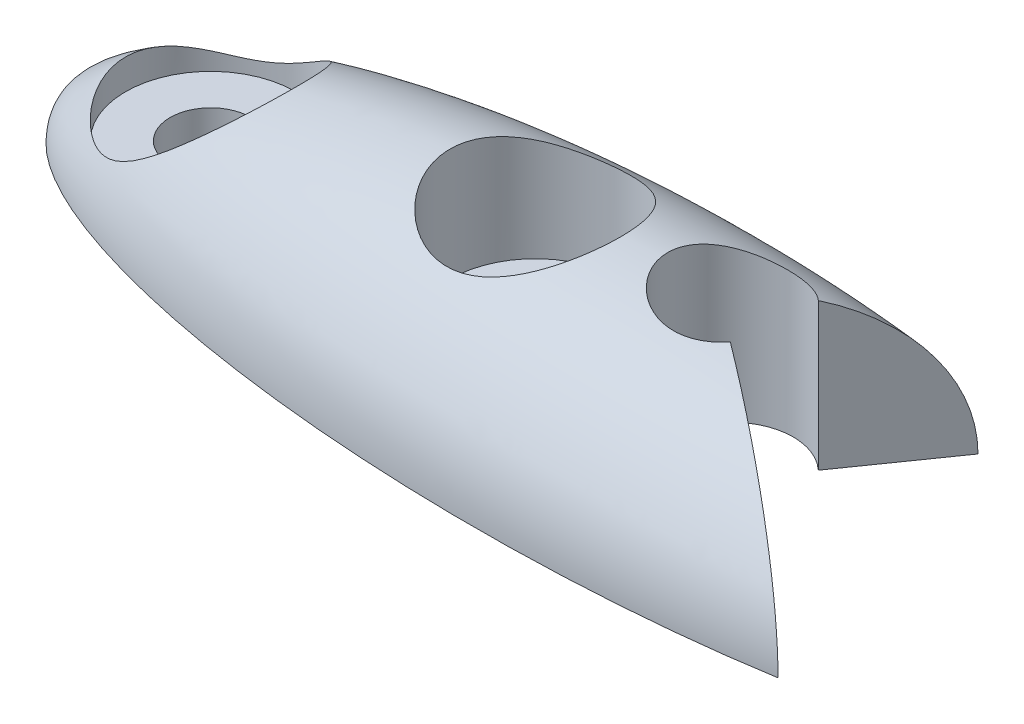
ISO-10303-21;
HEADER;
FILE_DESCRIPTION(('STEP AP214'),'2;1');
FILE_NAME('part.step','',(''),(''),'','','');
FILE_SCHEMA(('AUTOMOTIVE_DESIGN { 1 0 10303 214 1 1 1 1 }'));
ENDSEC;
DATA;
#1=APPLICATION_CONTEXT('core data for automotive mechanical design processes');
#2=APPLICATION_PROTOCOL_DEFINITION('international standard','automotive_design',2000,#1);
#3=PRODUCT_CONTEXT('',#1,'mechanical');
#4=PRODUCT('Part','Part','',(#3));
#5=PRODUCT_RELATED_PRODUCT_CATEGORY('part','',(#4));
#6=PRODUCT_DEFINITION_FORMATION('','',#4);
#7=PRODUCT_DEFINITION_CONTEXT('part definition',#1,'design');
#8=PRODUCT_DEFINITION('design','',#6,#7);
#9=PRODUCT_DEFINITION_SHAPE('','',#8);
#10=(LENGTH_UNIT() NAMED_UNIT(*) SI_UNIT(.MILLI.,.METRE.));
#11=(NAMED_UNIT(*) PLANE_ANGLE_UNIT() SI_UNIT($,.RADIAN.));
#12=(NAMED_UNIT(*) SI_UNIT($,.STERADIAN.) SOLID_ANGLE_UNIT());
#13=UNCERTAINTY_MEASURE_WITH_UNIT(LENGTH_MEASURE(1.E-05),#10,'distance_accuracy_value','');
#14=(GEOMETRIC_REPRESENTATION_CONTEXT(3) GLOBAL_UNCERTAINTY_ASSIGNED_CONTEXT((#13)) GLOBAL_UNIT_ASSIGNED_CONTEXT((#10,
#11,#12)) REPRESENTATION_CONTEXT('',''));
#15=CARTESIAN_POINT('',(0.,0.,0.));
#16=DIRECTION('',(0.,0.,1.));
#17=DIRECTION('',(1.,0.,0.));
#18=AXIS2_PLACEMENT_3D('',#15,#16,#17);
#19=CARTESIAN_POINT('',(0.,0.,0.));
#20=DIRECTION('',(0.,0.,1.));
#21=DIRECTION('',(1.,0.,0.));
#22=AXIS2_PLACEMENT_3D('',#19,#20,#21);
#23=ELLIPSE('',#22,14.,4.);
#24=TRIMMED_CURVE('',#23,(PARAMETER_VALUE(0.)),(PARAMETER_VALUE(3.14159265358979)),.T.,.PARAMETER.);
#25=CARTESIAN_POINT('',(-14.,0.,0.));
#26=DIRECTION('',(-1.,0.,0.));
#27=AXIS1_PLACEMENT('',#25,#26);
#28=SURFACE_OF_REVOLUTION('',#24,#27);
#29=CARTESIAN_POINT('',(0.,0.,0.));
#30=DIRECTION('',(0.,-1.,0.));
#31=DIRECTION('',(1.,0.,0.));
#32=AXIS2_PLACEMENT_3D('',#29,#30,#31);
#33=ELLIPSE('',#32,14.,4.);
#34=CARTESIAN_POINT('',(-14.,0.,0.));
#35=VERTEX_POINT('',#34);
#36=CARTESIAN_POINT('',(6.95727438490027,0.,3.47112089328106));
#37=VERTEX_POINT('',#36);
#38=EDGE_CURVE('E84',#35,#37,#33,.F.);
#39=ORIENTED_EDGE('',*,*,#38,.T.);
#40=CARTESIAN_POINT('',(6.95727438490027,0.,3.47112089328106));
#41=CARTESIAN_POINT('',(6.95729899317832,0.0771336940388308,3.47113812418285));
#42=CARTESIAN_POINT('',(6.954298902265,0.154250742922995,3.46903743791003));
#43=CARTESIAN_POINT('',(6.94243897243188,0.307743482883708,3.46073302563824));
#44=CARTESIAN_POINT('',(6.93358436457972,0.384119774075948,3.45453296247227));
#45=CARTESIAN_POINT('',(6.91031169026689,0.534868107737033,3.43823726048412));
#46=CARTESIAN_POINT('',(6.8959454148598,0.60925210988235,3.42817788614808));
#47=CARTESIAN_POINT('',(6.86197985583381,0.756206963489012,3.40439494567858));
#48=CARTESIAN_POINT('',(6.84237966872788,0.828777499539159,3.39067074691669));
#49=CARTESIAN_POINT('',(6.77644864333839,1.04259610943281,3.34450534593707));
#50=CARTESIAN_POINT('',(6.72288263608913,1.18059667751262,3.30699802386934));
#51=CARTESIAN_POINT('',(6.59986786402217,1.44573130953799,3.22086215315691));
#52=CARTESIAN_POINT('',(6.5303799706593,1.57283752493454,3.17220620640991));
#53=CARTESIAN_POINT('',(6.33635807267948,1.88330560454339,3.03635061086669));
#54=CARTESIAN_POINT('',(6.20279080908759,2.05830573893602,2.94282580604161));
#55=CARTESIAN_POINT('',(5.98710153145079,2.29982712178934,2.79179854792931));
#56=CARTESIAN_POINT('',(5.91251520114663,2.37694574702038,2.73957263720294));
#57=CARTESIAN_POINT('',(5.75904736922963,2.52453888042254,2.63211330442195));
#58=CARTESIAN_POINT('',(5.68016680526079,2.59501482991238,2.57688053891274));
#59=CARTESIAN_POINT('',(5.47431103299032,2.76682451454316,2.43273877538498));
#60=CARTESIAN_POINT('',(5.34483884855021,2.86369812884029,2.34208137585153));
#61=CARTESIAN_POINT('',(5.07948946919851,3.04341493222124,2.15628174017021));
#62=CARTESIAN_POINT('',(4.94360838099536,3.1262494487498,2.06113677791022));
#63=CARTESIAN_POINT('',(4.66688614683443,3.2789891827494,1.86737378356051));
#64=CARTESIAN_POINT('',(4.52603919590061,3.34887862811258,1.7687516867828));
#65=CARTESIAN_POINT('',(4.24076946080094,3.47646779310077,1.56900366784292));
#66=CARTESIAN_POINT('',(4.09634796341963,3.53417182999416,1.46787864669699));
#67=CARTESIAN_POINT('',(3.80003230031936,3.63984428167666,1.26039618570457));
#68=CARTESIAN_POINT('',(3.64804804286362,3.68743376863302,1.15397566294486));
#69=CARTESIAN_POINT('',(3.34279582600389,3.7707655516461,0.940235759644455));
#70=CARTESIAN_POINT('',(3.18953968787248,3.8065721917558,0.832924656447932));
#71=CARTESIAN_POINT('',(3.0356041302635,3.83691790722989,0.725137818611613));
#72=B_SPLINE_CURVE_WITH_KNOTS('',3,(#40,#41,#42,#43,#44,#45,#46,#47,#48,#49,#50,#51,#52,#53,#54,
#55,#56,#57,#58,#59,#60,#61,#62,#63,#64,#65,#66,#67,#68,#69,#70,#71),.UNSPECIFIED.,.F.,.F.,(4,2,
2,2,2,2,2,2,2,2,2,2,2,2,2,4),(0.,0.231287168003758,0.462367957448948,0.691328542939971,
0.920328677587783,1.37638002368096,1.83356438504328,2.54679526486869,2.90457330058979,
3.26227352654519,3.81757134845218,4.37321096122764,4.92952316784419,5.48563794211939,
6.05989116301108,6.63095433495631),.UNSPECIFIED.);
#73=CARTESIAN_POINT('',(3.0356041302635,3.836917907232,0.725137818611614));
#74=VERTEX_POINT('',#73);
#75=EDGE_CURVE('E70',#37,#74,#72,.T.);
#76=ORIENTED_EDGE('',*,*,#75,.T.);
#77=CARTESIAN_POINT('',(2.,3.49483467244949,-1.86));
#78=CARTESIAN_POINT('',(2.07813398084002,3.49118119917353,-1.86000374012296));
#79=CARTESIAN_POINT('',(2.15639189001948,3.49058815836243,-1.85387220877687));
#80=CARTESIAN_POINT('',(2.31081171926084,3.49536446472796,-1.82952462385525));
#81=CARTESIAN_POINT('',(2.38697370305525,3.50073363040114,-1.8113089381563));
#82=CARTESIAN_POINT('',(2.53483922547501,3.51659083272284,-1.76355724725854));
#83=CARTESIAN_POINT('',(2.60655391533183,3.52706543006083,-1.73405100640276));
#84=CARTESIAN_POINT('',(2.74407549456442,3.55186760177625,-1.66471740475829));
#85=CARTESIAN_POINT('',(2.80988028597874,3.56619653725444,-1.62488639811689));
#86=CARTESIAN_POINT('',(2.93742660450267,3.59806113498987,-1.5337471622023));
#87=CARTESIAN_POINT('',(2.99879397013011,3.61572238289601,-1.48196011416181));
#88=CARTESIAN_POINT('',(3.11237572388723,3.65206294309498,-1.36946253888777));
#89=CARTESIAN_POINT('',(3.16458692142663,3.67074260730811,-1.30874891456315));
#90=CARTESIAN_POINT('',(3.26229638595636,3.70895594542442,-1.17484754417608));
#91=CARTESIAN_POINT('',(3.30700157639869,3.7284491426146,-1.10106670366859));
#92=CARTESIAN_POINT('',(3.3832880658407,3.76513054238539,-0.946465458313844));
#93=CARTESIAN_POINT('',(3.41486998768289,3.78231885433176,-0.865645387775261));
#94=CARTESIAN_POINT('',(3.46347564235183,3.81284803287557,-0.700006662062822));
#95=CARTESIAN_POINT('',(3.48065331999071,3.8262285472587,-0.615240784158994));
#96=CARTESIAN_POINT('',(3.50016742024773,3.84847500453911,-0.443444497647411));
#97=CARTESIAN_POINT('',(3.50250978655014,3.85734275414055,-0.356415009976597));
#98=CARTESIAN_POINT('',(3.49233294347423,3.8698730802571,-0.18768897121882));
#99=CARTESIAN_POINT('',(3.48062278868515,3.87379475529151,-0.105962011557058));
#100=CARTESIAN_POINT('',(3.44392763315357,3.87753544019282,0.0545462099579809));
#101=CARTESIAN_POINT('',(3.41894362095768,3.87735475553374,0.133327690702898));
#102=CARTESIAN_POINT('',(3.35697599682675,3.87361639650224,0.28433313752473));
#103=CARTESIAN_POINT('',(3.32020564053266,3.87011672068354,0.356646427794222));
#104=CARTESIAN_POINT('',(3.23559044296188,3.86082280970727,0.494310726404858));
#105=CARTESIAN_POINT('',(3.18774377020389,3.85502819496622,0.559660580721635));
#106=CARTESIAN_POINT('',(3.08071018563367,3.84216894991756,0.683531225712975));
#107=CARTESIAN_POINT('',(3.02123557278116,3.83507246349745,0.741800161986131));
#108=CARTESIAN_POINT('',(2.89345638754544,3.8211390044576,0.847735440121681));
#109=CARTESIAN_POINT('',(2.82515065837589,3.81430206598805,0.895400390740512));
#110=CARTESIAN_POINT('',(2.68010345158286,3.80213624965375,0.979635732692089));
#111=CARTESIAN_POINT('',(2.60322570791636,3.79683868871741,1.01597669214485));
#112=CARTESIAN_POINT('',(2.44431511974431,3.78914919444723,1.07519000791509));
#113=CARTESIAN_POINT('',(2.36228339574874,3.78675663183043,1.09806528062665));
#114=CARTESIAN_POINT('',(2.19733076248174,3.7856795935481,1.12927852098915));
#115=CARTESIAN_POINT('',(2.11446850878938,3.78691518764403,1.13792339843417));
#116=CARTESIAN_POINT('',(1.94861034174323,3.79312322111809,1.14141337128388));
#117=CARTESIAN_POINT('',(1.86561443852983,3.79809538919599,1.13625946850257));
#118=CARTESIAN_POINT('',(1.70315733001067,3.8113073210463,1.11258611708747));
#119=CARTESIAN_POINT('',(1.62366086740444,3.81949372784729,1.09428105696014));
#120=CARTESIAN_POINT('',(1.50770054438527,3.83359211152056,1.05749508512385));
#121=CARTESIAN_POINT('',(1.46958457794677,3.83859631045396,1.04367333457854));
#122=CARTESIAN_POINT('',(1.39461387059919,3.84908089668869,1.01300720808066));
#123=CARTESIAN_POINT('',(1.35776033197716,3.85456172124848,0.99616004118386));
#124=CARTESIAN_POINT('',(1.24753305355959,3.87180181192037,0.940266857150052));
#125=CARTESIAN_POINT('',(1.17656335493366,3.88409556621877,0.896524537990685));
#126=CARTESIAN_POINT('',(1.04282911683376,3.90864680174716,0.79789813224214));
#127=CARTESIAN_POINT('',(0.980065159595881,3.92090428034298,0.743013255740497));
#128=CARTESIAN_POINT('',(0.892560103519131,3.93828650954848,0.652620898601896));
#129=CARTESIAN_POINT('',(0.864178275139749,3.94397973120257,0.620679951502467));
#130=CARTESIAN_POINT('',(0.810221812349645,3.9547645453586,0.55446781211344));
#131=CARTESIAN_POINT('',(0.784644580397147,3.95985669489755,0.520198824467914));
#132=CARTESIAN_POINT('',(0.712380706445735,3.97395126574799,0.414167611376933));
#133=CARTESIAN_POINT('',(0.670120833995368,3.98178038233834,0.339138732164209));
#134=CARTESIAN_POINT('',(0.600009477424749,3.99278031204923,0.184974260773067));
#135=CARTESIAN_POINT('',(0.571776661189163,3.99607929046712,0.106020176668773));
#136=CARTESIAN_POINT('',(0.528852260301651,3.99757836848931,-0.0555350332339738));
#137=CARTESIAN_POINT('',(0.51415573365918,3.99578032995196,-0.1381348164661));
#138=CARTESIAN_POINT('',(0.499082483460972,3.98694898592746,-0.300316651283961));
#139=CARTESIAN_POINT('',(0.498051641217094,3.98017137943129,-0.379853004568259));
#140=CARTESIAN_POINT('',(0.5084493758468,3.9618493534093,-0.537539597040193));
#141=CARTESIAN_POINT('',(0.519878225372812,3.95030482957362,-0.615689805857132));
#142=CARTESIAN_POINT('',(0.554652845414492,3.92298905637996,-0.768863946664043));
#143=CARTESIAN_POINT('',(0.5780500729569,3.90719969694212,-0.843872853781919));
#144=CARTESIAN_POINT('',(0.635876953163032,3.8723514381495,-0.988690576415194));
#145=CARTESIAN_POINT('',(0.670309605748675,3.85329165040143,-1.0584979715599));
#146=CARTESIAN_POINT('',(0.751778044842553,3.81173267934246,-1.1959055876264));
#147=CARTESIAN_POINT('',(0.799494467082705,3.78908965620416,-1.26305772756657));
#148=CARTESIAN_POINT('',(0.905102839536795,3.74295890896315,-1.38855467501068));
#149=CARTESIAN_POINT('',(0.96299806036892,3.71947091529254,-1.44689664042361));
#150=CARTESIAN_POINT('',(1.05847616016047,3.68418465635237,-1.52851975770722));
#151=CARTESIAN_POINT('',(1.09289246246056,3.67205769585422,-1.555435515615));
#152=CARTESIAN_POINT('',(1.16402357899013,3.6483353833349,-1.60621521962495));
#153=CARTESIAN_POINT('',(1.20073620605052,3.63673954314448,-1.63008200576759));
#154=CARTESIAN_POINT('',(1.31410852755447,3.6031372853172,-1.69687475218746));
#155=CARTESIAN_POINT('',(1.39403490634876,3.58230381824152,-1.73502072482995));
#156=CARTESIAN_POINT('',(1.5597762347769,3.54616450090575,-1.79664947415311));
#157=CARTESIAN_POINT('',(1.64553962729876,3.53081624693128,-1.82024580610957));
#158=CARTESIAN_POINT('',(1.82081716070665,3.50725185904008,-1.85191018181923));
#159=CARTESIAN_POINT('',(1.91032696262704,3.49902770142476,-1.85999570752466));
#160=CARTESIAN_POINT('',(2.,3.49483467244949,-1.86));
#161=B_SPLINE_CURVE_WITH_KNOTS('',3,(#77,#78,#79,#80,#81,#82,#83,#84,#85,#86,#87,#88,#89,#90,
#91,#92,#93,#94,#95,#96,#97,#98,#99,#100,#101,#102,#103,#104,#105,#106,#107,#108,#109,#110,#111,
#112,#113,#114,#115,#116,#117,#118,#119,#120,#121,#122,#123,#124,#125,#126,#127,#128,#129,#130,
#131,#132,#133,#134,#135,#136,#137,#138,#139,#140,#141,#142,#143,#144,#145,#146,#147,#148,#149,
#150,#151,#152,#153,#154,#155,#156,#157,#158,#159,#160),.UNSPECIFIED.,.T.,.F.,(4,2,2,2,2,2,2,2,
2,2,2,2,2,2,2,2,2,2,2,2,2,2,2,2,2,2,2,2,2,2,2,2,2,2,2,2,2,2,2,2,2,4),(0.,0.23432618358403,
0.468645233929142,0.702350777523002,0.936138959259956,1.18175848764287,1.42746343612483,
1.69152724114886,1.9555785120275,2.21677041531258,2.47785766690364,2.72460740262986,
2.97133876468957,3.21383649335386,3.45637434796505,3.70591957097056,3.95549751504134,
4.20984504798451,4.4641374741343,4.71287002577553,4.96158451951682,5.20633391261261,
5.32877523671773,5.45133009857153,5.70292412784257,5.95453599922057,6.08371384848466,
6.21277102773639,6.47070884209065,6.72118739103048,6.97157445597457,7.20993074199577,
7.44829224401474,7.68768728412733,7.92714745779382,8.18237688541685,8.4376884729044,
8.57357221552781,8.70932844837196,8.98071002403127,9.2499458184562,9.51887798333614),.UNSPECIFIED.);
#162=CARTESIAN_POINT('',(3.02131845917517,3.62316589454559,-1.45859392176912));
#163=VERTEX_POINT('',#162);
#164=EDGE_CURVE('E82',#74,#163,#161,.T.);
#165=ORIENTED_EDGE('',*,*,#164,.T.);
#166=CARTESIAN_POINT('',(3.02131845919602,3.62316589455198,-1.45859392174973));
#167=CARTESIAN_POINT('',(3.10312318801509,3.57056346259623,-1.57542318215476));
#168=CARTESIAN_POINT('',(3.18364649371288,3.51176254992309,-1.69042238068334));
#169=CARTESIAN_POINT('',(3.34145901074546,3.3816743348428,-1.91580201232238));
#170=CARTESIAN_POINT('',(3.41874272475972,3.31036679434614,-2.02617459444547));
#171=CARTESIAN_POINT('',(3.56950902791259,3.15495951944685,-2.24149118977713));
#172=CARTESIAN_POINT('',(3.64297063543001,3.07079749084506,-2.3464052381252));
#173=CARTESIAN_POINT('',(3.78465295156627,2.89022835412037,-2.5487485555058));
#174=CARTESIAN_POINT('',(3.85287777412861,2.7938310191917,-2.64618369985855));
#175=CARTESIAN_POINT('',(4.01204663612491,2.54351704293118,-2.87350039285397));
#176=CARTESIAN_POINT('',(4.09968690789246,2.38302196207202,-2.99866367228914));
#177=CARTESIAN_POINT('',(4.21874837715094,2.12536913968606,-3.16870107229043));
#178=CARTESIAN_POINT('',(4.25635468892719,2.03671086264167,-3.2224084514946));
#179=CARTESIAN_POINT('',(4.32705362551475,1.85410081001322,-3.32337699686091));
#180=CARTESIAN_POINT('',(4.36014846067727,1.76015165875336,-3.37064131973173));
#181=CARTESIAN_POINT('',(4.42165899365845,1.56663044446219,-3.45848746480245));
#182=CARTESIAN_POINT('',(4.45003141462322,1.46701652500224,-3.49900748124972));
#183=CARTESIAN_POINT('',(4.50130955230663,1.26364572412119,-3.57224025137173));
#184=CARTESIAN_POINT('',(4.52421802820876,1.15989096477419,-3.60495694556886));
#185=CARTESIAN_POINT('',(4.56418494078839,0.949146274530476,-3.66203561210509));
#186=CARTESIAN_POINT('',(4.5812504417865,0.842160421719726,-3.68640767333961));
#187=CARTESIAN_POINT('',(4.6092594949214,0.625835522635707,-3.72640874674493));
#188=CARTESIAN_POINT('',(4.62020731486845,0.516498172248363,-3.74204385398049));
#189=CARTESIAN_POINT('',(4.63278076552365,0.339038530933366,-3.76000060247159));
#190=CARTESIAN_POINT('',(4.63637407431042,0.271322801591031,-3.76513237925302));
#191=CARTESIAN_POINT('',(4.6411638088188,0.135741653274764,-3.77197282904399));
#192=CARTESIAN_POINT('',(4.64236400844082,0.0678766392152351,-3.77368689174187));
#193=CARTESIAN_POINT('',(4.64236206356356,0.,-3.77368411416928));
#194=B_SPLINE_CURVE_WITH_KNOTS('',3,(#166,#167,#168,#169,#170,#171,#172,#173,#174,#175,#176,
#177,#178,#179,#180,#181,#182,#183,#184,#185,#186,#187,#188,#189,#190,#191,#192,#193),
.UNSPECIFIED.,.F.,.F.,(4,2,2,2,2,2,2,2,2,2,2,2,2,4),(0.,0.455968624057858,0.912682016180067,
1.37168335839429,1.83032034467316,2.4918819633124,2.82236091947257,3.15267737445217,
3.48587156815276,3.81889714748561,4.15151865587516,4.4839078305795,4.68780462428776,
4.89137962043056),.UNSPECIFIED.);
#195=CARTESIAN_POINT('',(4.64236206356355,0.,-3.77368411416928));
#196=VERTEX_POINT('',#195);
#197=EDGE_CURVE('E54',#163,#196,#194,.T.);
#198=ORIENTED_EDGE('',*,*,#197,.T.);
#199=CARTESIAN_POINT('',(0.,0.,0.));
#200=DIRECTION('',(0.,1.,0.));
#201=DIRECTION('',(1.,0.,0.));
#202=AXIS2_PLACEMENT_3D('',#199,#200,#201);
#203=ELLIPSE('',#202,14.,4.);
#204=EDGE_CURVE('E133',#196,#35,#203,.T.);
#205=ORIENTED_EDGE('',*,*,#204,.T.);
#206=EDGE_LOOP('',(#39,#76,#165,#198,#205));
#207=FACE_BOUND('',#206,.T.);
#208=CARTESIAN_POINT('',(-10.5,1.60934769394311,-2.1));
#209=CARTESIAN_POINT('',(-10.4209734122459,1.65143420426542,-2.10000131762377));
#210=CARTESIAN_POINT('',(-10.3434440073707,1.69639745496097,-2.0955506533599));
#211=CARTESIAN_POINT('',(-10.1913598551556,1.78981821811153,-2.07860705529194));
#212=CARTESIAN_POINT('',(-10.1168101155128,1.83828125799034,-2.06610114131829));
#213=CARTESIAN_POINT('',(-9.9702390854039,1.93737193467093,-2.03347456598901));
#214=CARTESIAN_POINT('',(-9.89823486498157,1.98801044720783,-2.0133103862909));
#215=CARTESIAN_POINT('',(-9.75728236048426,2.08994580493803,-1.96568019855641));
#216=CARTESIAN_POINT('',(-9.68833214900592,2.14124220778922,-1.93821887466169));
#217=CARTESIAN_POINT('',(-9.50384966054523,2.28128860333896,-1.85319269734035));
#218=CARTESIAN_POINT('',(-9.39139419718499,2.36980964779735,-1.78834943335908));
#219=CARTESIAN_POINT('',(-9.17804799775228,2.54126946025989,-1.63690809906218));
#220=CARTESIAN_POINT('',(-9.07711759067938,2.62422694514435,-1.55038814449628));
#221=CARTESIAN_POINT('',(-8.91173851584674,2.76192528082536,-1.37775167826839));
#222=CARTESIAN_POINT('',(-8.84426104589568,2.81874482278595,-1.29620793524524));
#223=CARTESIAN_POINT('',(-8.7203960034258,2.92377252538621,-1.12007409785245));
#224=CARTESIAN_POINT('',(-8.6639988354946,2.97198813358289,-1.02549541345599));
#225=CARTESIAN_POINT('',(-8.5740398918738,3.04924074394735,-0.84213324180284));
#226=CARTESIAN_POINT('',(-8.53820531513645,3.08016019413125,-0.7552662403171));
#227=CARTESIAN_POINT('',(-8.477982597523,3.13224440516493,-0.574862054009301));
#228=CARTESIAN_POINT('',(-8.45358655875996,3.15341589643704,-0.481329523044182));
#229=CARTESIAN_POINT('',(-8.41773500422139,3.18456055682782,-0.289393883857317));
#230=CARTESIAN_POINT('',(-8.40635313301124,3.19446999435238,-0.190966314314159));
#231=CARTESIAN_POINT('',(-8.39767888741019,3.20202019189904,0.00697522794760886));
#232=CARTESIAN_POINT('',(-8.40038261359837,3.1996643474107,0.106488892382527));
#233=CARTESIAN_POINT('',(-8.41873570469273,3.18369703721893,0.293897740398332));
#234=CARTESIAN_POINT('',(-8.43315543324997,3.1711547263428,0.382011563798604));
#235=CARTESIAN_POINT('',(-8.47247589693887,3.13703140760446,0.55401471590958));
#236=CARTESIAN_POINT('',(-8.49737770678136,3.11544947292536,0.637903610457433));
#237=CARTESIAN_POINT('',(-8.55782508813899,3.06323349557525,0.803829344657878));
#238=CARTESIAN_POINT('',(-8.59383623869343,3.0322044842708,0.885569295890076));
#239=CARTESIAN_POINT('',(-8.67440631180034,2.96310978518446,1.04160126414614));
#240=CARTESIAN_POINT('',(-8.71897666801134,2.92503468751805,1.11588311396859));
#241=CARTESIAN_POINT('',(-8.80274422162959,2.85391825405269,1.23827323190543));
#242=CARTESIAN_POINT('',(-8.84037173915895,2.8221036628096,1.28819723736775));
#243=CARTESIAN_POINT('',(-8.91894785418084,2.75603284049121,1.38350456211226));
#244=CARTESIAN_POINT('',(-8.95989365712104,2.72177866683991,1.42889163175704));
#245=CARTESIAN_POINT('',(-9.087247194751,2.61594150151342,1.55846640545728));
#246=CARTESIAN_POINT('',(-9.17808335655521,2.54135892327486,1.63594262709184));
#247=CARTESIAN_POINT('',(-9.37047946915258,2.38651034596648,1.7744035676839));
#248=CARTESIAN_POINT('',(-9.47220260800227,2.30616637481496,1.83506739491974));
#249=CARTESIAN_POINT('',(-9.68362943352589,2.144247987393,1.93839845790641));
#250=CARTESIAN_POINT('',(-9.79333497425821,2.06267328877361,1.98106149690082));
#251=CARTESIAN_POINT('',(-9.95958958358823,1.94511399084755,2.03002216434123));
#252=CARTESIAN_POINT('',(-10.0132997641207,1.90800768331128,2.04358172053704));
#253=CARTESIAN_POINT('',(-10.1223508849207,1.83493174396179,2.06651562606789));
#254=CARTESIAN_POINT('',(-10.1776911560524,1.79896165796824,2.07589166785951));
#255=CARTESIAN_POINT('',(-10.2900085972404,1.72881992264886,2.09024040538197));
#256=CARTESIAN_POINT('',(-10.3469843607261,1.69464679552613,2.0952167743518));
#257=CARTESIAN_POINT('',(-10.4626038773335,1.62892616784999,2.10046473860563));
#258=CARTESIAN_POINT('',(-10.5212467400815,1.59737729979757,2.10073879973694));
#259=CARTESIAN_POINT('',(-10.6573795081354,1.52939078707956,2.09549537066697));
#260=CARTESIAN_POINT('',(-10.7354436786617,1.49415271019503,2.08829133336176));
#261=CARTESIAN_POINT('',(-10.853994199151,1.44811551509979,2.07033406210167));
#262=CARTESIAN_POINT('',(-10.8937270569378,1.43391347395169,2.06316343128542));
#263=CARTESIAN_POINT('',(-10.9735099095893,1.40814918471928,2.04632559362616));
#264=CARTESIAN_POINT('',(-11.0135597215001,1.39658551445941,2.03665973781586));
#265=CARTESIAN_POINT('',(-11.094165425735,1.37631410519305,2.01462958903609));
#266=CARTESIAN_POINT('',(-11.1347218960432,1.36764032251293,2.00223587277453));
#267=CARTESIAN_POINT('',(-11.2155088195142,1.35356054578818,1.97480788042425));
#268=CARTESIAN_POINT('',(-11.2557392974718,1.34815430086942,1.95977380717055));
#269=CARTESIAN_POINT('',(-11.3354743741771,1.34065222387266,1.92713229554071));
#270=CARTESIAN_POINT('',(-11.3749787001983,1.33855761143784,1.90952391167716));
#271=CARTESIAN_POINT('',(-11.4528545616125,1.33751879409295,1.87188132543829));
#272=CARTESIAN_POINT('',(-11.4912259428332,1.3385750159741,1.85184679478578));
#273=CARTESIAN_POINT('',(-11.5702846954148,1.34374710704501,1.80741439405524));
#274=CARTESIAN_POINT('',(-11.6108197315259,1.34815849589994,1.78278052071496));
#275=CARTESIAN_POINT('',(-11.6898629605472,1.35979142511742,1.73102925729613));
#276=CARTESIAN_POINT('',(-11.7283696418467,1.36701502853506,1.70391005516081));
#277=CARTESIAN_POINT('',(-11.8407591611483,1.39195810494593,1.61900846877252));
#278=CARTESIAN_POINT('',(-11.9113541157072,1.41293486024175,1.55777127741802));
#279=CARTESIAN_POINT('',(-12.0205232280511,1.45091517137529,1.44973473438894));
#280=CARTESIAN_POINT('',(-12.0617853202022,1.46682014260002,1.40517049037538));
#281=CARTESIAN_POINT('',(-12.1402296174059,1.49925324334537,1.31275157201679));
#282=CARTESIAN_POINT('',(-12.1774108147228,1.5157815254385,1.26489608965811));
#283=CARTESIAN_POINT('',(-12.2475218437144,1.54852476985896,1.16611939467008));
#284=CARTESIAN_POINT('',(-12.280454351601,1.56473992389472,1.11520014181994));
#285=CARTESIAN_POINT('',(-12.3419357662032,1.59610282638224,1.01042678547276));
#286=CARTESIAN_POINT('',(-12.3704826700093,1.61125008542674,0.95657135614381));
#287=CARTESIAN_POINT('',(-12.422981407253,1.63982405970158,0.846101743234768));
#288=CARTESIAN_POINT('',(-12.4469253515469,1.65324780811135,0.789483028146517));
#289=CARTESIAN_POINT('',(-12.4898720929744,1.67775946941476,0.673946465806939));
#290=CARTESIAN_POINT('',(-12.5088780049872,1.68884885396815,0.61503009501276));
#291=CARTESIAN_POINT('',(-12.5416782411809,1.70821415204776,0.495372580425835));
#292=CARTESIAN_POINT('',(-12.5554778436637,1.71649291420378,0.434633352527247));
#293=CARTESIAN_POINT('',(-12.5776552732665,1.72988690088153,0.311832077653073));
#294=CARTESIAN_POINT('',(-12.5860340945654,1.73500270548646,0.249770275397372));
#295=CARTESIAN_POINT('',(-12.5964623460617,1.74138415262275,0.133366998522504));
#296=CARTESIAN_POINT('',(-12.5992117213289,1.74307522746053,0.0791103312854765));
#297=CARTESIAN_POINT('',(-12.6004951649014,1.74386381373383,-0.0294910821492246));
#298=CARTESIAN_POINT('',(-12.5990278819685,1.74296049378938,-0.0838358510023145));
#299=CARTESIAN_POINT('',(-12.5918966478564,1.73858812267192,-0.19211991894679));
#300=CARTESIAN_POINT('',(-12.5862347232754,1.73512031050859,-0.24605940114025));
#301=CARTESIAN_POINT('',(-12.5708028519786,1.72574235922895,-0.353138898051337));
#302=CARTESIAN_POINT('',(-12.5610313135067,1.71983127378724,-0.406278594722712));
#303=CARTESIAN_POINT('',(-12.5272853501419,1.69963384488084,-0.556959295468164));
#304=CARTESIAN_POINT('',(-12.4983415829939,1.68252904179946,-0.653062124292442));
#305=CARTESIAN_POINT('',(-12.427682085743,1.6423395516025,-0.839029756730497));
#306=CARTESIAN_POINT('',(-12.3859607319181,1.61925223212809,-0.928891792215082));
#307=CARTESIAN_POINT('',(-12.2856158082219,1.56692767275004,-1.11062804395449));
#308=CARTESIAN_POINT('',(-12.2256428579024,1.53729400345931,-1.20164776709639));
#309=CARTESIAN_POINT('',(-12.1256965750334,1.49313266816627,-1.33043947233908));
#310=CARTESIAN_POINT('',(-12.0906877101672,1.47844989655063,-1.37210774222008));
#311=CARTESIAN_POINT('',(-12.0173929775362,1.44991209877204,-1.45275233193063));
#312=CARTESIAN_POINT('',(-11.9791073635288,1.43605700865278,-1.49172885979186));
#313=CARTESIAN_POINT('',(-11.875155402858,1.40212093381479,-1.58954840528397));
#314=CARTESIAN_POINT('',(-11.8069059963234,1.38332721104376,-1.64618927394501));
#315=CARTESIAN_POINT('',(-11.6987994325602,1.36146467530663,-1.72477916896278));
#316=CARTESIAN_POINT('',(-11.6618431070227,1.35523451270557,-1.74989482843937));
#317=CARTESIAN_POINT('',(-11.5861545851853,1.34542149519424,-1.7978518339282));
#318=CARTESIAN_POINT('',(-11.5474235378886,1.34183695245546,-1.82069462190347));
#319=CARTESIAN_POINT('',(-11.474443927403,1.33810486701482,-1.86062285206911));
#320=CARTESIAN_POINT('',(-11.4404076652084,1.33751810545354,-1.87805584649113));
#321=CARTESIAN_POINT('',(-11.3714830723181,1.33881436140664,-1.9110142183121));
#322=CARTESIAN_POINT('',(-11.3365951356071,1.34069625739824,-1.92654045845485));
#323=CARTESIAN_POINT('',(-11.2662130141211,1.34704218684759,-1.9555989047031));
#324=CARTESIAN_POINT('',(-11.2307186367657,1.3515070559172,-1.96913046373532));
#325=CARTESIAN_POINT('',(-11.1594289129819,1.36299733785046,-1.99413710104801));
#326=CARTESIAN_POINT('',(-11.1236335581081,1.37002282280025,-2.0056121214195));
#327=CARTESIAN_POINT('',(-11.016507099062,1.39469851254764,-2.03684163251687));
#328=CARTESIAN_POINT('',(-10.9450889677904,1.41598055073299,-2.05354190738941));
#329=CARTESIAN_POINT('',(-10.8037040274116,1.4663154035419,-2.07917016403377));
#330=CARTESIAN_POINT('',(-10.7337377150047,1.49537083188171,-2.08809552727376));
#331=CARTESIAN_POINT('',(-10.6370138946536,1.54006945064786,-2.09571141022123));
#332=CARTESIAN_POINT('',(-10.6093503715588,1.55338893107564,-2.09733153220967));
#333=CARTESIAN_POINT('',(-10.5543993698054,1.58080911553577,-2.09947511372935));
#334=CARTESIAN_POINT('',(-10.5271115783923,1.59490911376028,-2.09999954796403));
#335=CARTESIAN_POINT('',(-10.5,1.60934769394311,-2.1));
#336=B_SPLINE_CURVE_WITH_KNOTS('',3,(#208,#209,#210,#211,#212,#213,#214,#215,#216,#217,#218,
#219,#220,#221,#222,#223,#224,#225,#226,#227,#228,#229,#230,#231,#232,#233,#234,#235,#236,#237,
#238,#239,#240,#241,#242,#243,#244,#245,#246,#247,#248,#249,#250,#251,#252,#253,#254,#255,#256,
#257,#258,#259,#260,#261,#262,#263,#264,#265,#266,#267,#268,#269,#270,#271,#272,#273,#274,#275,
#276,#277,#278,#279,#280,#281,#282,#283,#284,#285,#286,#287,#288,#289,#290,#291,#292,#293,#294,
#295,#296,#297,#298,#299,#300,#301,#302,#303,#304,#305,#306,#307,#308,#309,#310,#311,#312,#313,
#314,#315,#316,#317,#318,#319,#320,#321,#322,#323,#324,#325,#326,#327,#328,#329,#330,#331,#332,
#333,#334,#335),.UNSPECIFIED.,.T.,.F.,(4,2,2,2,2,2,2,2,2,2,2,2,2,2,2,2,2,2,2,2,2,2,2,2,2,2,2,2,
2,2,2,2,2,2,2,2,2,2,2,2,2,2,2,2,2,2,2,2,2,2,2,2,2,2,2,2,2,2,2,2,2,2,2,4),(0.,0.268554998493359,
0.537543830814705,0.808084642577288,1.07845220808125,1.54786523546352,2.0156103886229,
2.37472670912209,2.73353065486925,3.02909682375592,3.32445861352174,3.62148365094237,
3.91842646507802,4.18770265154609,4.45700645319287,4.73963185375287,5.02263745404392,
5.2328017180642,5.44279079206636,5.86327311238737,6.29130104421253,6.7194287126539,
6.91932977174217,7.11914988661361,7.31880301587502,7.51835144565678,7.77523057694287,
7.90350310332526,8.03170632204323,8.16136677861864,8.29101727889417,8.42071551711898,
8.55043132420828,8.69312404722196,8.8359216482102,9.122054649787,9.31022286265116,
9.49843743770076,9.68653287311728,9.87471395814579,10.0632147514279,10.2515963493348,
10.4397864441961,10.6279420149392,10.7907806447794,10.9536714624677,11.1164836324029,
11.2793589217133,11.5834115416423,11.8875981751965,12.2250477336122,12.3940172641632,
12.5629737212301,12.8338695745852,12.9690826531743,13.1042093950115,13.218819194977,
13.3333769451966,13.4479717764786,13.5625698340686,13.7906534810167,14.018813915157,
14.1110288979053,14.2031618129308),.UNSPECIFIED.);
#337=CARTESIAN_POINT('',(-10.5,1.60934769394311,-2.1));
#338=VERTEX_POINT('',#337);
#339=EDGE_CURVE('E120',#338,#338,#336,.T.);
#340=ORIENTED_EDGE('',*,*,#339,.T.);
#341=EDGE_LOOP('',(#340));
#342=FACE_BOUND('',#341,.T.);
#343=CARTESIAN_POINT('',(-2.5,3.32863274008524,-2.1));
#344=CARTESIAN_POINT('',(-2.44391161577788,3.33207241469365,-2.09999925599985));
#345=CARTESIAN_POINT('',(-2.38789049764947,3.33680893166559,-2.09774819969757));
#346=CARTESIAN_POINT('',(-2.27645767598402,3.34874642241738,-2.08881815710808));
#347=CARTESIAN_POINT('',(-2.22104634451073,3.35594882310566,-2.08213660496817));
#348=CARTESIAN_POINT('',(-2.05615239948845,3.38099072121608,-2.05557301051361));
#349=CARTESIAN_POINT('',(-1.9481635913042,3.40225468114947,-2.02917251836015));
#350=CARTESIAN_POINT('',(-1.73980589875892,3.45129396390937,-1.96063649206154));
#351=CARTESIAN_POINT('',(-1.639394222034,3.47902842226906,-1.9185987633047));
#352=CARTESIAN_POINT('',(-1.44714860293507,3.53835176977569,-1.82020875247125));
#353=CARTESIAN_POINT('',(-1.35531370040707,3.56994022655931,-1.76385807533616));
#354=CARTESIAN_POINT('',(-1.17327885786032,3.6374072738103,-1.6320586200521));
#355=CARTESIAN_POINT('',(-1.08406980600099,3.67340773220385,-1.55530112817339));
#356=CARTESIAN_POINT('',(-0.919302880826147,3.74360935195551,-1.38752485155579));
#357=CARTESIAN_POINT('',(-0.843751459013751,3.77780965759036,-1.29649936470182));
#358=CARTESIAN_POINT('',(-0.705513372268102,3.84266479726031,-1.09775425924636));
#359=CARTESIAN_POINT('',(-0.643497057358,3.8731114751832,-0.989495586815082));
#360=CARTESIAN_POINT('',(-0.539134681228779,3.92548632017736,-0.761989388772922));
#361=CARTESIAN_POINT('',(-0.496770980746052,3.94742212330447,-0.64275183296776));
#362=CARTESIAN_POINT('',(-0.436998463495097,3.97867696273786,-0.408872538765789));
#363=CARTESIAN_POINT('',(-0.417596516915212,3.98899899423367,-0.294875401895555));
#364=CARTESIAN_POINT('',(-0.397832820920056,3.9995147625313,-0.0648027848691478));
#365=CARTESIAN_POINT('',(-0.397459786871686,3.99971450211133,0.0512714226704454));
#366=CARTESIAN_POINT('',(-0.414919656337209,3.99042250162698,0.271121137895605));
#367=CARTESIAN_POINT('',(-0.431128105640163,3.98179549019895,0.375068524143967));
#368=CARTESIAN_POINT('',(-0.478555607572038,3.95691563372474,0.578510352689527));
#369=CARTESIAN_POINT('',(-0.509776021828295,3.94066209693455,0.678004390160507));
#370=CARTESIAN_POINT('',(-0.586828534153472,3.90142493324214,0.872321205089944));
#371=CARTESIAN_POINT('',(-0.632966278514083,3.87830142916614,0.966993537919268));
#372=CARTESIAN_POINT('',(-0.738110008395319,3.82725696448566,1.14745974684105));
#373=CARTESIAN_POINT('',(-0.797120567886952,3.79933429939235,1.23325045109352));
#374=CARTESIAN_POINT('',(-0.933339194768508,3.7376022547778,1.40307706755962));
#375=CARTESIAN_POINT('',(-1.01180444706205,3.70348263647092,1.48599289779391));
#376=CARTESIAN_POINT('',(-1.18096527799704,3.63463922713156,1.63802026271514));
#377=CARTESIAN_POINT('',(-1.27167124588486,3.5999149449395,1.70711994601701));
#378=CARTESIAN_POINT('',(-1.47156856822899,3.5302049174921,1.83507033462144));
#379=CARTESIAN_POINT('',(-1.58165951703625,3.49542221517065,1.89265195143558));
#380=CARTESIAN_POINT('',(-1.75423957728495,3.44849831389915,1.96411077931303));
#381=CARTESIAN_POINT('',(-1.81302601964945,3.43372831949967,1.98544903852781));
#382=CARTESIAN_POINT('',(-1.93273171098295,3.40642959668742,2.02290178671983));
#383=CARTESIAN_POINT('',(-1.9936496222568,3.39389949166721,2.039019489165));
#384=CARTESIAN_POINT('',(-2.11311187835204,3.37227268378995,2.06489838821059));
#385=CARTESIAN_POINT('',(-2.17155014299811,3.36300478786238,2.0750069350759));
#386=CARTESIAN_POINT('',(-2.28940269919866,3.3471422938869,2.09025754194513));
#387=CARTESIAN_POINT('',(-2.34881643674859,3.34054622957754,2.0954023281352));
#388=CARTESIAN_POINT('',(-2.46808094460892,3.33024419574658,2.10060451596095));
#389=CARTESIAN_POINT('',(-2.52793138708164,3.32653624631651,2.10066540583994));
#390=CARTESIAN_POINT('',(-2.64751097577498,3.32209013734597,2.09566870580353));
#391=CARTESIAN_POINT('',(-2.70724012974846,3.32135178160552,2.09061145406949));
#392=CARTESIAN_POINT('',(-2.87011479174544,3.32336539458009,2.0697501087653));
#393=CARTESIAN_POINT('',(-2.97261574357997,3.32911113573177,2.04875801098503));
#394=CARTESIAN_POINT('',(-3.17263705668561,3.34837474300922,1.99208299576235));
#395=CARTESIAN_POINT('',(-3.27015579864996,3.36189511875058,1.95639533571785));
#396=CARTESIAN_POINT('',(-3.45992190798297,3.39500509079679,1.8707230891793));
#397=CARTESIAN_POINT('',(-3.55202688499407,3.41470942737196,1.82046971665862));
#398=CARTESIAN_POINT('',(-3.72723687851905,3.45766413201622,1.70727130297969));
#399=CARTESIAN_POINT('',(-3.81033623886852,3.48091670680772,1.64431835579446));
#400=CARTESIAN_POINT('',(-3.93185792666445,3.51804558147017,1.53726073852721));
#401=CARTESIAN_POINT('',(-3.9738691381876,3.53155316150772,1.49702605497538));
#402=CARTESIAN_POINT('',(-4.05438327612886,3.55850019621063,1.41324666691049));
#403=CARTESIAN_POINT('',(-4.09288942207831,3.57193970246411,1.36970506876819));
#404=CARTESIAN_POINT('',(-4.20292849602845,3.61160636691093,1.23432117478876));
#405=CARTESIAN_POINT('',(-4.26898322163343,3.63718204289314,1.13771875529651));
#406=CARTESIAN_POINT('',(-4.38652597743582,3.68449822751391,0.930437355214653));
#407=CARTESIAN_POINT('',(-4.43741949058905,3.7060720709952,0.819382602364769));
#408=CARTESIAN_POINT('',(-4.51939244663154,3.74157343397784,0.589034714555428));
#409=CARTESIAN_POINT('',(-4.55048587263501,3.75550634864875,0.46974745964511));
#410=CARTESIAN_POINT('',(-4.58977688920198,3.77322673974795,0.236164445978591));
#411=CARTESIAN_POINT('',(-4.59954353045436,3.77770857611671,0.122184560818386));
#412=CARTESIAN_POINT('',(-4.60042469833342,3.77810991635259,-0.105848008889527));
#413=CARTESIAN_POINT('',(-4.5915443873273,3.77403179002645,-0.219900664551894));
#414=CARTESIAN_POINT('',(-4.55655961795326,3.75823928353904,-0.438331778380602));
#415=CARTESIAN_POINT('',(-4.53141946479229,3.74695284243605,-0.542898834577591));
#416=CARTESIAN_POINT('',(-4.46585016358407,3.71829537518612,-0.74622316102837));
#417=CARTESIAN_POINT('',(-4.42541872423746,3.70092343719601,-0.844979558028839));
#418=CARTESIAN_POINT('',(-4.32852552480262,3.66090095744106,-1.03861374974156));
#419=CARTESIAN_POINT('',(-4.27144999963677,3.63805579190258,-1.1331429331282));
#420=CARTESIAN_POINT('',(-4.14360354280919,3.58980193673981,-1.31173115587026));
#421=CARTESIAN_POINT('',(-4.07282548566082,3.56439191666407,-1.395784710225));
#422=CARTESIAN_POINT('',(-3.91256466173476,3.51141856799547,-1.55845501269279));
#423=CARTESIAN_POINT('',(-3.82200776534935,3.48385438798028,-1.63601522521525));
#424=CARTESIAN_POINT('',(-3.62825561786266,3.43226114004218,-1.77517361825625));
#425=CARTESIAN_POINT('',(-3.52505419109971,3.40823381225103,-1.83676395286471));
#426=CARTESIAN_POINT('',(-3.36278318306288,3.37767274714122,-1.91552374503184));
#427=CARTESIAN_POINT('',(-3.30744694740846,3.36839892615762,-1.93950637379101));
#428=CARTESIAN_POINT('',(-3.19463595807222,3.35209679017999,-1.98270562354184));
#429=CARTESIAN_POINT('',(-3.13716237233149,3.34506726836249,-2.00192480472664));
#430=CARTESIAN_POINT('',(-3.02067683705897,3.33364251544636,-2.03532777348412));
#431=CARTESIAN_POINT('',(-2.96166921351836,3.32924057086812,-2.04952435566242));
#432=CARTESIAN_POINT('',(-2.84253473808941,3.32332579232087,-2.07276335989499));
#433=CARTESIAN_POINT('',(-2.78240870423461,3.32181092455758,-2.08180940707864));
#434=CARTESIAN_POINT('',(-2.68512690897311,3.32181496508629,-2.09215351141045));
#435=CARTESIAN_POINT('',(-2.64813614577169,3.32238280200047,-2.09509674241132));
#436=CARTESIAN_POINT('',(-2.57408714691002,3.32465629934229,-2.099020185881));
#437=CARTESIAN_POINT('',(-2.53702891452348,3.32636190595745,-2.10000049118046));
#438=CARTESIAN_POINT('',(-2.5,3.32863274008524,-2.1));
#439=B_SPLINE_CURVE_WITH_KNOTS('',3,(#343,#344,#345,#346,#347,#348,#349,#350,#351,#352,#353,
#354,#355,#356,#357,#358,#359,#360,#361,#362,#363,#364,#365,#366,#367,#368,#369,#370,#371,#372,
#373,#374,#375,#376,#377,#378,#379,#380,#381,#382,#383,#384,#385,#386,#387,#388,#389,#390,#391,
#392,#393,#394,#395,#396,#397,#398,#399,#400,#401,#402,#403,#404,#405,#406,#407,#408,#409,#410,
#411,#412,#413,#414,#415,#416,#417,#418,#419,#420,#421,#422,#423,#424,#425,#426,#427,#428,#429,
#430,#431,#432,#433,#434,#435,#436,#437,#438),.UNSPECIFIED.,.T.,.F.,(4,2,2,2,2,2,2,2,2,2,2,2,2,
2,2,2,2,2,2,2,2,2,2,2,2,2,2,2,2,2,2,2,2,2,2,2,2,2,2,2,2,2,2,2,2,2,2,4),(0.,0.1685385640739,
0.337174819981447,0.674903014121057,1.01055341550269,1.34616619628991,1.71378081633715,
2.08156863660764,2.46474142829905,2.84756963349099,3.19392156005566,3.54006808865692,
3.85527246060646,4.17050542787142,4.49265685185611,4.81492292973359,5.17086336147396,
5.52710781853337,5.91196762621177,6.1045155319482,6.29694469027289,6.47676302426089,
6.65648254248943,6.83607874770681,7.01566308687392,7.32839873433791,7.64123538811653,
7.96025887199543,8.2794815779244,8.45846018705069,8.63727270287236,8.99489301259736,
9.365100159969,9.73504557078246,10.0767006449545,10.4182611451511,10.7412213851538,
11.0642300378245,11.4011079710002,11.7381615577193,12.103644007222,12.4693056773988,
12.6521432498328,12.8348823390656,13.0171525075223,13.1992942286715,13.3105667377706,
13.4218339844484),.UNSPECIFIED.);
#440=CARTESIAN_POINT('',(-2.5,3.32863274008524,-2.1));
#441=VERTEX_POINT('',#440);
#442=EDGE_CURVE('E127',#441,#441,#439,.T.);
#443=ORIENTED_EDGE('',*,*,#442,.T.);
#444=EDGE_LOOP('',(#443));
#445=FACE_BOUND('',#444,.T.);
#446=ADVANCED_FACE('F35',(#207,#342,#445),#28,.T.);
#447=CARTESIAN_POINT('',(-26.9157785627443,0.,-4.));
#448=DIRECTION('',(0.,1.,0.));
#449=DIRECTION('',(0.,0.,1.));
#450=AXIS2_PLACEMENT_3D('',#447,#448,#449);
#451=PLANE('',#450);
#452=CARTESIAN_POINT('',(-10.5,0.,0.));
#453=DIRECTION('',(0.,-1.,0.));
#454=DIRECTION('',(0.,0.,-1.));
#455=AXIS2_PLACEMENT_3D('',#452,#453,#454);
#456=CIRCLE('',#455,1.);
#457=CARTESIAN_POINT('',(-10.5,0.,-1.));
#458=VERTEX_POINT('',#457);
#459=EDGE_CURVE('E186',#458,#458,#456,.T.);
#460=ORIENTED_EDGE('',*,*,#459,.F.);
#461=EDGE_LOOP('',(#460));
#462=FACE_BOUND('',#461,.T.);
#463=CARTESIAN_POINT('',(-2.5,0.,0.));
#464=DIRECTION('',(0.,-1.,0.));
#465=DIRECTION('',(0.,0.,-1.));
#466=AXIS2_PLACEMENT_3D('',#463,#464,#465);
#467=CIRCLE('',#466,1.);
#468=CARTESIAN_POINT('',(-2.5,0.,-1.));
#469=VERTEX_POINT('',#468);
#470=EDGE_CURVE('E126',#469,#469,#467,.T.);
#471=ORIENTED_EDGE('',*,*,#470,.F.);
#472=EDGE_LOOP('',(#471));
#473=FACE_BOUND('',#472,.T.);
#474=CARTESIAN_POINT('',(2.,0.,-0.36));
#475=DIRECTION('',(0.,-1.,0.));
#476=DIRECTION('',(0.,0.,-1.));
#477=AXIS2_PLACEMENT_3D('',#474,#475,#476);
#478=CIRCLE('',#477,1.5);
#479=CARTESIAN_POINT('',(3.0356041302635,0.,0.725137818611614));
#480=VERTEX_POINT('',#479);
#481=CARTESIAN_POINT('',(3.02131845919603,0.,-1.45859392174973));
#482=VERTEX_POINT('',#481);
#483=EDGE_CURVE('E85',#480,#482,#478,.T.);
#484=ORIENTED_EDGE('',*,*,#483,.F.);
#485=DIRECTION('',(0.819152044288993,0.,0.573576436351044));
#486=VECTOR('',#485,1.);
#487=CARTESIAN_POINT('',(0.657979856674327,0.,-0.939692620785907));
#488=LINE('',#487,#486);
#489=EDGE_CURVE('E40',#37,#480,#488,.F.);
#490=ORIENTED_EDGE('',*,*,#489,.F.);
#491=ORIENTED_EDGE('',*,*,#38,.F.);
#492=ORIENTED_EDGE('',*,*,#204,.F.);
#493=DIRECTION('',(-0.573576436351045,0.,0.819152044288992));
#494=VECTOR('',#493,1.);
#495=CARTESIAN_POINT('',(1.34202014332567,0.,0.939692620785908));
#496=LINE('',#495,#494);
#497=EDGE_CURVE('E139',#482,#196,#496,.F.);
#498=ORIENTED_EDGE('',*,*,#497,.F.);
#499=EDGE_LOOP('',(#484,#490,#491,#492,#498));
#500=FACE_BOUND('',#499,.T.);
#501=ADVANCED_FACE('F150',(#462,#473,#500),#451,.F.);
#502=CARTESIAN_POINT('',(-2.5,4.,0.));
#503=DIRECTION('',(0.,-1.,0.));
#504=DIRECTION('',(0.,0.,-1.));
#505=AXIS2_PLACEMENT_3D('',#502,#503,#504);
#506=CYLINDRICAL_SURFACE('',#505,1.);
#507=CARTESIAN_POINT('',(-2.5,1.,0.));
#508=DIRECTION('',(0.,-1.,0.));
#509=DIRECTION('',(0.,0.,-1.));
#510=AXIS2_PLACEMENT_3D('',#507,#508,#509);
#511=CIRCLE('',#510,1.);
#512=CARTESIAN_POINT('',(-2.5,1.,-1.));
#513=VERTEX_POINT('',#512);
#514=EDGE_CURVE('E178',#513,#513,#511,.F.);
#515=ORIENTED_EDGE('',*,*,#514,.T.);
#516=EDGE_LOOP('',(#515));
#517=FACE_BOUND('',#516,.T.);
#518=ORIENTED_EDGE('',*,*,#470,.T.);
#519=EDGE_LOOP('',(#518));
#520=FACE_BOUND('',#519,.T.);
#521=ADVANCED_FACE('F154',(#517,#520),#506,.F.);
#522=CARTESIAN_POINT('',(-10.5,4.,0.));
#523=DIRECTION('',(0.,-1.,0.));
#524=DIRECTION('',(0.,0.,-1.));
#525=AXIS2_PLACEMENT_3D('',#522,#523,#524);
#526=CYLINDRICAL_SURFACE('',#525,1.);
#527=CARTESIAN_POINT('',(-10.5,1.,0.));
#528=DIRECTION('',(0.,-1.,0.));
#529=DIRECTION('',(0.,0.,-1.));
#530=AXIS2_PLACEMENT_3D('',#527,#528,#529);
#531=CIRCLE('',#530,1.);
#532=CARTESIAN_POINT('',(-10.5,1.,-1.));
#533=VERTEX_POINT('',#532);
#534=EDGE_CURVE('E180',#533,#533,#531,.F.);
#535=ORIENTED_EDGE('',*,*,#534,.T.);
#536=EDGE_LOOP('',(#535));
#537=FACE_BOUND('',#536,.T.);
#538=ORIENTED_EDGE('',*,*,#459,.T.);
#539=EDGE_LOOP('',(#538));
#540=FACE_BOUND('',#539,.T.);
#541=ADVANCED_FACE('F116',(#537,#540),#526,.F.);
#542=CARTESIAN_POINT('',(-10.5,4.,0.));
#543=DIRECTION('',(0.,-1.,0.));
#544=DIRECTION('',(0.,0.,-1.));
#545=AXIS2_PLACEMENT_3D('',#542,#543,#544);
#546=CYLINDRICAL_SURFACE('',#545,2.1);
#547=CARTESIAN_POINT('',(-10.5,1.,0.));
#548=DIRECTION('',(0.,-1.,0.));
#549=DIRECTION('',(0.,0.,-1.));
#550=AXIS2_PLACEMENT_3D('',#547,#548,#549);
#551=CIRCLE('',#550,2.1);
#552=CARTESIAN_POINT('',(-10.5,1.,-2.1));
#553=VERTEX_POINT('',#552);
#554=EDGE_CURVE('E91',#553,#553,#551,.T.);
#555=ORIENTED_EDGE('',*,*,#554,.T.);
#556=EDGE_LOOP('',(#555));
#557=FACE_BOUND('',#556,.T.);
#558=ORIENTED_EDGE('',*,*,#339,.F.);
#559=EDGE_LOOP('',(#558));
#560=FACE_BOUND('',#559,.T.);
#561=ADVANCED_FACE('F111',(#557,#560),#546,.F.);
#562=CARTESIAN_POINT('',(-10.5,1.,0.));
#563=DIRECTION('',(0.,-1.,0.));
#564=DIRECTION('',(0.,0.,-1.));
#565=AXIS2_PLACEMENT_3D('',#562,#563,#564);
#566=PLANE('',#565);
#567=ORIENTED_EDGE('',*,*,#554,.F.);
#568=EDGE_LOOP('',(#567));
#569=FACE_BOUND('',#568,.T.);
#570=ORIENTED_EDGE('',*,*,#534,.F.);
#571=EDGE_LOOP('',(#570));
#572=FACE_BOUND('',#571,.T.);
#573=ADVANCED_FACE('F107',(#569,#572),#566,.F.);
#574=CARTESIAN_POINT('',(-2.5,4.,0.));
#575=DIRECTION('',(0.,-1.,0.));
#576=DIRECTION('',(0.,0.,-1.));
#577=AXIS2_PLACEMENT_3D('',#574,#575,#576);
#578=CYLINDRICAL_SURFACE('',#577,2.1);
#579=CARTESIAN_POINT('',(-2.5,1.,0.));
#580=DIRECTION('',(0.,-1.,0.));
#581=DIRECTION('',(0.,0.,-1.));
#582=AXIS2_PLACEMENT_3D('',#579,#580,#581);
#583=CIRCLE('',#582,2.1);
#584=CARTESIAN_POINT('',(-2.5,1.,-2.1));
#585=VERTEX_POINT('',#584);
#586=EDGE_CURVE('E88',#585,#585,#583,.T.);
#587=ORIENTED_EDGE('',*,*,#586,.T.);
#588=EDGE_LOOP('',(#587));
#589=FACE_BOUND('',#588,.T.);
#590=ORIENTED_EDGE('',*,*,#442,.F.);
#591=EDGE_LOOP('',(#590));
#592=FACE_BOUND('',#591,.T.);
#593=ADVANCED_FACE('F110',(#589,#592),#578,.F.);
#594=CARTESIAN_POINT('',(-2.5,1.,0.));
#595=DIRECTION('',(0.,-1.,0.));
#596=DIRECTION('',(0.,0.,-1.));
#597=AXIS2_PLACEMENT_3D('',#594,#595,#596);
#598=PLANE('',#597);
#599=ORIENTED_EDGE('',*,*,#586,.F.);
#600=EDGE_LOOP('',(#599));
#601=FACE_BOUND('',#600,.T.);
#602=ORIENTED_EDGE('',*,*,#514,.F.);
#603=EDGE_LOOP('',(#602));
#604=FACE_BOUND('',#603,.T.);
#605=ADVANCED_FACE('F104',(#601,#604),#598,.F.);
#606=CARTESIAN_POINT('',(2.,4.,-0.36));
#607=DIRECTION('',(0.,-1.,0.));
#608=DIRECTION('',(0.,0.,-1.));
#609=AXIS2_PLACEMENT_3D('',#606,#607,#608);
#610=CYLINDRICAL_SURFACE('',#609,1.5);
#611=ORIENTED_EDGE('',*,*,#164,.F.);
#612=DIRECTION('',(0.,-1.,0.));
#613=VECTOR('',#612,1.);
#614=CARTESIAN_POINT('',(3.0356041302635,4.,0.725137818611614));
#615=LINE('',#614,#613);
#616=EDGE_CURVE('E11',#74,#480,#615,.T.);
#617=ORIENTED_EDGE('',*,*,#616,.T.);
#618=ORIENTED_EDGE('',*,*,#483,.T.);
#619=DIRECTION('',(0.,-1.,0.));
#620=VECTOR('',#619,1.);
#621=CARTESIAN_POINT('',(3.02131845919603,4.,-1.45859392174973));
#622=LINE('',#621,#620);
#623=EDGE_CURVE('E46',#482,#163,#622,.F.);
#624=ORIENTED_EDGE('',*,*,#623,.T.);
#625=EDGE_LOOP('',(#611,#617,#618,#624));
#626=FACE_BOUND('',#625,.T.);
#627=ADVANCED_FACE('F87',(#626),#610,.F.);
#628=CARTESIAN_POINT('',(1.34202014332567,4.,0.939692620785908));
#629=DIRECTION('',(-0.819152044288992,0.,-0.573576436351045));
#630=DIRECTION('',(-0.573576436351045,0.,0.819152044288992));
#631=AXIS2_PLACEMENT_3D('',#628,#629,#630);
#632=PLANE('',#631);
#633=ORIENTED_EDGE('',*,*,#623,.F.);
#634=ORIENTED_EDGE('',*,*,#497,.T.);
#635=ORIENTED_EDGE('',*,*,#197,.F.);
#636=EDGE_LOOP('',(#633,#634,#635));
#637=FACE_BOUND('',#636,.T.);
#638=ADVANCED_FACE('F103',(#637),#632,.F.);
#639=CARTESIAN_POINT('',(0.657979856674327,4.,-0.939692620785907));
#640=DIRECTION('',(-0.573576436351044,0.,0.819152044288993));
#641=DIRECTION('',(0.819152044288993,0.,0.573576436351044));
#642=AXIS2_PLACEMENT_3D('',#639,#640,#641);
#643=PLANE('',#642);
#644=ORIENTED_EDGE('',*,*,#489,.T.);
#645=ORIENTED_EDGE('',*,*,#616,.F.);
#646=ORIENTED_EDGE('',*,*,#75,.F.);
#647=EDGE_LOOP('',(#644,#645,#646));
#648=FACE_BOUND('',#647,.T.);
#649=ADVANCED_FACE('F73',(#648),#643,.F.);
#650=CLOSED_SHELL('',(#446,#501,#521,#541,#561,#573,#593,#605,#627,#638,#649));
#651=MANIFOLD_SOLID_BREP('B2',#650);
#652=ADVANCED_BREP_SHAPE_REPRESENTATION('',(#18,#651),#14);
#653=SHAPE_DEFINITION_REPRESENTATION(#9,#652);
ENDSEC;
END-ISO-10303-21;
